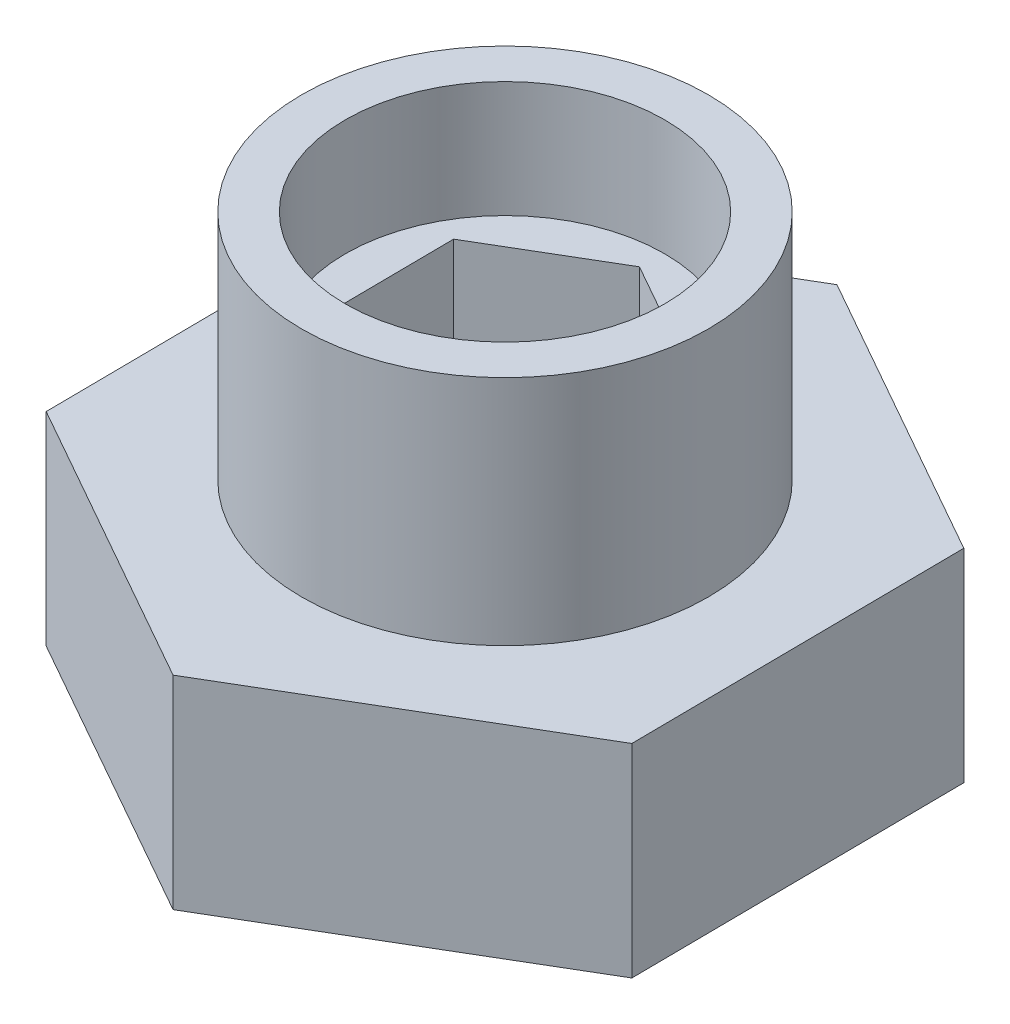
ISO-10303-21;
HEADER;
FILE_DESCRIPTION(('STEP AP214'),'2;1');
FILE_NAME('part.step','',(''),(''),'','','');
FILE_SCHEMA(('AUTOMOTIVE_DESIGN { 1 0 10303 214 1 1 1 1 }'));
ENDSEC;
DATA;
#1=APPLICATION_CONTEXT('core data for automotive mechanical design processes');
#2=APPLICATION_PROTOCOL_DEFINITION('international standard','automotive_design',2000,#1);
#3=PRODUCT_CONTEXT('',#1,'mechanical');
#4=PRODUCT('Part','Part','',(#3));
#5=PRODUCT_RELATED_PRODUCT_CATEGORY('part','',(#4));
#6=PRODUCT_DEFINITION_FORMATION('','',#4);
#7=PRODUCT_DEFINITION_CONTEXT('part definition',#1,'design');
#8=PRODUCT_DEFINITION('design','',#6,#7);
#9=PRODUCT_DEFINITION_SHAPE('','',#8);
#10=(LENGTH_UNIT() NAMED_UNIT(*) SI_UNIT(.MILLI.,.METRE.));
#11=(NAMED_UNIT(*) PLANE_ANGLE_UNIT() SI_UNIT($,.RADIAN.));
#12=(NAMED_UNIT(*) SI_UNIT($,.STERADIAN.) SOLID_ANGLE_UNIT());
#13=UNCERTAINTY_MEASURE_WITH_UNIT(LENGTH_MEASURE(1.E-05),#10,'distance_accuracy_value','');
#14=(GEOMETRIC_REPRESENTATION_CONTEXT(3) GLOBAL_UNCERTAINTY_ASSIGNED_CONTEXT((#13)) GLOBAL_UNIT_ASSIGNED_CONTEXT((#10,
#11,#12)) REPRESENTATION_CONTEXT('',''));
#15=CARTESIAN_POINT('',(0.,0.,0.));
#16=DIRECTION('',(0.,0.,1.));
#17=DIRECTION('',(1.,0.,0.));
#18=AXIS2_PLACEMENT_3D('',#15,#16,#17);
#19=CARTESIAN_POINT('',(10.0530968349787,15.,5.68054375565173));
#20=DIRECTION('',(-0.999957022608578,0.,0.00927108061594633));
#21=DIRECTION('',(0.00927108061594633,0.,0.999957022608578));
#22=AXIS2_PLACEMENT_3D('',#19,#20,#21);
#23=PLANE('',#22);
#24=DIRECTION('',(-0.00927108061594633,0.,-0.999957022608578));
#25=VECTOR('',#24,1.);
#26=CARTESIAN_POINT('',(10.0530968349787,7.,5.68054375565173));
#27=LINE('',#26,#25);
#28=CARTESIAN_POINT('',(10.0530968349787,7.,5.68054375565173));
#29=VERTEX_POINT('',#28);
#30=CARTESIAN_POINT('',(9.94604361719283,7.,-5.86596536797065));
#31=VERTEX_POINT('',#30);
#32=EDGE_CURVE('E198',#29,#31,#27,.T.);
#33=ORIENTED_EDGE('',*,*,#32,.F.);
#34=DIRECTION('',(0.,-1.,0.));
#35=VECTOR('',#34,1.);
#36=CARTESIAN_POINT('',(10.0530968349787,15.,5.68054375565173));
#37=LINE('',#36,#35);
#38=CARTESIAN_POINT('',(10.0530968349787,0.,5.68054375565173));
#39=VERTEX_POINT('',#38);
#40=EDGE_CURVE('E218',#29,#39,#37,.T.);
#41=ORIENTED_EDGE('',*,*,#40,.T.);
#42=DIRECTION('',(-0.00927108061594633,0.,-0.999957022608578));
#43=VECTOR('',#42,1.);
#44=CARTESIAN_POINT('',(10.0530968349787,0.,5.68054375565173));
#45=LINE('',#44,#43);
#46=CARTESIAN_POINT('',(9.94604361719283,0.,-5.86596536797065));
#47=VERTEX_POINT('',#46);
#48=EDGE_CURVE('E200',#39,#47,#45,.T.);
#49=ORIENTED_EDGE('',*,*,#48,.T.);
#50=DIRECTION('',(0.,-1.,0.));
#51=VECTOR('',#50,1.);
#52=CARTESIAN_POINT('',(9.94604361719283,15.,-5.86596536797065));
#53=LINE('',#52,#51);
#54=EDGE_CURVE('E41',#31,#47,#53,.T.);
#55=ORIENTED_EDGE('',*,*,#54,.F.);
#56=EDGE_LOOP('',(#33,#41,#49,#55));
#57=FACE_BOUND('',#56,.T.);
#58=ADVANCED_FACE('F34',(#57),#23,.F.);
#59=CARTESIAN_POINT('',(9.94604361719283,15.,-5.86596536797065));
#60=DIRECTION('',(-0.491949519970346,0.,0.870623724579652));
#61=DIRECTION('',(0.870623724579652,0.,0.491949519970347));
#62=AXIS2_PLACEMENT_3D('',#59,#60,#61);
#63=PLANE('',#62);
#64=DIRECTION('',(-0.870623724579652,0.,-0.491949519970347));
#65=VECTOR('',#64,1.);
#66=CARTESIAN_POINT('',(9.94604361719283,7.,-5.86596536797065));
#67=LINE('',#66,#65);
#68=CARTESIAN_POINT('',(-0.107053217785902,7.,-11.5465091236224));
#69=VERTEX_POINT('',#68);
#70=EDGE_CURVE('E196',#31,#69,#67,.T.);
#71=ORIENTED_EDGE('',*,*,#70,.F.);
#72=ORIENTED_EDGE('',*,*,#54,.T.);
#73=DIRECTION('',(-0.870623724579652,0.,-0.491949519970346));
#74=VECTOR('',#73,1.);
#75=CARTESIAN_POINT('',(9.94604361719283,0.,-5.86596536797065));
#76=LINE('',#75,#74);
#77=CARTESIAN_POINT('',(-0.107053217785902,0.,-11.5465091236224));
#78=VERTEX_POINT('',#77);
#79=EDGE_CURVE('E203',#47,#78,#76,.T.);
#80=ORIENTED_EDGE('',*,*,#79,.T.);
#81=DIRECTION('',(0.,-1.,0.));
#82=VECTOR('',#81,1.);
#83=CARTESIAN_POINT('',(-0.107053217785902,15.,-11.5465091236224));
#84=LINE('',#83,#82);
#85=EDGE_CURVE('E226',#69,#78,#84,.T.);
#86=ORIENTED_EDGE('',*,*,#85,.F.);
#87=EDGE_LOOP('',(#71,#72,#80,#86));
#88=FACE_BOUND('',#87,.T.);
#89=ADVANCED_FACE('F231',(#88),#63,.F.);
#90=CARTESIAN_POINT('',(-0.107053217785902,15.,-11.5465091236224));
#91=DIRECTION('',(0.508007502638232,0.,0.861352643963706));
#92=DIRECTION('',(0.861352643963706,0.,-0.508007502638232));
#93=AXIS2_PLACEMENT_3D('',#90,#91,#92);
#94=PLANE('',#93);
#95=DIRECTION('',(-0.861352643963706,0.,0.508007502638232));
#96=VECTOR('',#95,1.);
#97=CARTESIAN_POINT('',(-0.107053217785902,7.,-11.5465091236224));
#98=LINE('',#97,#96);
#99=CARTESIAN_POINT('',(-10.0530968349787,7.,-5.68054375565173));
#100=VERTEX_POINT('',#99);
#101=EDGE_CURVE('E194',#69,#100,#98,.T.);
#102=ORIENTED_EDGE('',*,*,#101,.F.);
#103=ORIENTED_EDGE('',*,*,#85,.T.);
#104=DIRECTION('',(-0.861352643963706,0.,0.508007502638232));
#105=VECTOR('',#104,1.);
#106=CARTESIAN_POINT('',(-0.107053217785902,0.,-11.5465091236224));
#107=LINE('',#106,#105);
#108=CARTESIAN_POINT('',(-10.0530968349787,0.,-5.68054375565173));
#109=VERTEX_POINT('',#108);
#110=EDGE_CURVE('E206',#78,#109,#107,.T.);
#111=ORIENTED_EDGE('',*,*,#110,.T.);
#112=DIRECTION('',(0.,-1.,0.));
#113=VECTOR('',#112,1.);
#114=CARTESIAN_POINT('',(-10.0530968349787,15.,-5.68054375565173));
#115=LINE('',#114,#113);
#116=EDGE_CURVE('E224',#100,#109,#115,.T.);
#117=ORIENTED_EDGE('',*,*,#116,.F.);
#118=EDGE_LOOP('',(#102,#103,#111,#117));
#119=FACE_BOUND('',#118,.T.);
#120=ADVANCED_FACE('F255',(#119),#94,.F.);
#121=CARTESIAN_POINT('',(-10.0530968349787,15.,-5.68054375565173));
#122=DIRECTION('',(0.999957022608578,0.,-0.00927108061594633));
#123=DIRECTION('',(-0.00927108061594633,0.,-0.999957022608578));
#124=AXIS2_PLACEMENT_3D('',#121,#122,#123);
#125=PLANE('',#124);
#126=DIRECTION('',(0.00927108061594633,0.,0.999957022608578));
#127=VECTOR('',#126,1.);
#128=CARTESIAN_POINT('',(-10.0530968349787,7.,-5.68054375565173));
#129=LINE('',#128,#127);
#130=CARTESIAN_POINT('',(-9.94604361719282,7.,5.86596536797066));
#131=VERTEX_POINT('',#130);
#132=EDGE_CURVE('E192',#100,#131,#129,.T.);
#133=ORIENTED_EDGE('',*,*,#132,.F.);
#134=ORIENTED_EDGE('',*,*,#116,.T.);
#135=DIRECTION('',(0.00927108061594633,0.,0.999957022608578));
#136=VECTOR('',#135,1.);
#137=CARTESIAN_POINT('',(-10.0530968349787,0.,-5.68054375565173));
#138=LINE('',#137,#136);
#139=CARTESIAN_POINT('',(-9.94604361719282,0.,5.86596536797066));
#140=VERTEX_POINT('',#139);
#141=EDGE_CURVE('E209',#109,#140,#138,.T.);
#142=ORIENTED_EDGE('',*,*,#141,.T.);
#143=DIRECTION('',(0.,-1.,0.));
#144=VECTOR('',#143,1.);
#145=CARTESIAN_POINT('',(-9.94604361719282,15.,5.86596536797066));
#146=LINE('',#145,#144);
#147=EDGE_CURVE('E222',#131,#140,#146,.T.);
#148=ORIENTED_EDGE('',*,*,#147,.F.);
#149=EDGE_LOOP('',(#133,#134,#142,#148));
#150=FACE_BOUND('',#149,.T.);
#151=ADVANCED_FACE('F251',(#150),#125,.F.);
#152=CARTESIAN_POINT('',(-9.94604361719282,15.,5.86596536797066));
#153=DIRECTION('',(0.491949519970346,0.,-0.870623724579652));
#154=DIRECTION('',(-0.870623724579652,0.,-0.491949519970346));
#155=AXIS2_PLACEMENT_3D('',#152,#153,#154);
#156=PLANE('',#155);
#157=DIRECTION('',(0.870623724579652,0.,0.491949519970346));
#158=VECTOR('',#157,1.);
#159=CARTESIAN_POINT('',(-9.94604361719282,7.,5.86596536797066));
#160=LINE('',#159,#158);
#161=CARTESIAN_POINT('',(0.107053217785901,7.,11.5465091236224));
#162=VERTEX_POINT('',#161);
#163=EDGE_CURVE('E55',#131,#162,#160,.T.);
#164=ORIENTED_EDGE('',*,*,#163,.F.);
#165=ORIENTED_EDGE('',*,*,#147,.T.);
#166=DIRECTION('',(0.870623724579652,0.,0.491949519970346));
#167=VECTOR('',#166,1.);
#168=CARTESIAN_POINT('',(-9.94604361719282,0.,5.86596536797066));
#169=LINE('',#168,#167);
#170=CARTESIAN_POINT('',(0.107053217785901,0.,11.5465091236224));
#171=VERTEX_POINT('',#170);
#172=EDGE_CURVE('E212',#140,#171,#169,.T.);
#173=ORIENTED_EDGE('',*,*,#172,.T.);
#174=DIRECTION('',(0.,-1.,0.));
#175=VECTOR('',#174,1.);
#176=CARTESIAN_POINT('',(0.107053217785901,15.,11.5465091236224));
#177=LINE('',#176,#175);
#178=EDGE_CURVE('E220',#162,#171,#177,.T.);
#179=ORIENTED_EDGE('',*,*,#178,.F.);
#180=EDGE_LOOP('',(#164,#165,#173,#179));
#181=FACE_BOUND('',#180,.T.);
#182=ADVANCED_FACE('F247',(#181),#156,.F.);
#183=CARTESIAN_POINT('',(0.107053217785901,15.,11.5465091236224));
#184=DIRECTION('',(-0.508007502638232,0.,-0.861352643963706));
#185=DIRECTION('',(-0.861352643963706,0.,0.508007502638232));
#186=AXIS2_PLACEMENT_3D('',#183,#184,#185);
#187=PLANE('',#186);
#188=DIRECTION('',(0.861352643963706,0.,-0.508007502638232));
#189=VECTOR('',#188,1.);
#190=CARTESIAN_POINT('',(0.107053217785901,7.,11.5465091236224));
#191=LINE('',#190,#189);
#192=EDGE_CURVE('E12',#162,#29,#191,.T.);
#193=ORIENTED_EDGE('',*,*,#192,.F.);
#194=ORIENTED_EDGE('',*,*,#178,.T.);
#195=DIRECTION('',(0.861352643963706,0.,-0.508007502638232));
#196=VECTOR('',#195,1.);
#197=CARTESIAN_POINT('',(0.107053217785901,0.,11.5465091236224));
#198=LINE('',#197,#196);
#199=EDGE_CURVE('E215',#171,#39,#198,.T.);
#200=ORIENTED_EDGE('',*,*,#199,.T.);
#201=ORIENTED_EDGE('',*,*,#40,.F.);
#202=EDGE_LOOP('',(#193,#194,#200,#201));
#203=FACE_BOUND('',#202,.T.);
#204=ADVANCED_FACE('F243',(#203),#187,.F.);
#205=CARTESIAN_POINT('',(0.,0.,0.));
#206=DIRECTION('',(0.,1.,0.));
#207=DIRECTION('',(0.,0.,1.));
#208=AXIS2_PLACEMENT_3D('',#205,#206,#207);
#209=PLANE('',#208);
#210=CARTESIAN_POINT('',(0.,0.,0.));
#211=DIRECTION('',(0.,1.,0.));
#212=DIRECTION('',(0.,0.,1.));
#213=AXIS2_PLACEMENT_3D('',#210,#211,#212);
#214=CIRCLE('',#213,3.);
#215=CARTESIAN_POINT('',(0.,0.,3.));
#216=VERTEX_POINT('',#215);
#217=EDGE_CURVE('E160',#216,#216,#214,.T.);
#218=ORIENTED_EDGE('',*,*,#217,.T.);
#219=EDGE_LOOP('',(#218));
#220=FACE_BOUND('',#219,.T.);
#221=ORIENTED_EDGE('',*,*,#48,.F.);
#222=ORIENTED_EDGE('',*,*,#199,.F.);
#223=ORIENTED_EDGE('',*,*,#172,.F.);
#224=ORIENTED_EDGE('',*,*,#141,.F.);
#225=ORIENTED_EDGE('',*,*,#110,.F.);
#226=ORIENTED_EDGE('',*,*,#79,.F.);
#227=EDGE_LOOP('',(#221,#222,#223,#224,#225,#226));
#228=FACE_BOUND('',#227,.T.);
#229=ADVANCED_FACE('F238',(#220,#228),#209,.F.);
#230=CARTESIAN_POINT('',(0.,7.,0.));
#231=DIRECTION('',(0.,1.,0.));
#232=DIRECTION('',(0.,0.,1.));
#233=AXIS2_PLACEMENT_3D('',#230,#231,#232);
#234=PLANE('',#233);
#235=CARTESIAN_POINT('',(0.,7.,0.));
#236=DIRECTION('',(0.,1.,0.));
#237=DIRECTION('',(0.,0.,1.));
#238=AXIS2_PLACEMENT_3D('',#235,#236,#237);
#239=CIRCLE('',#238,7.00000000000001);
#240=CARTESIAN_POINT('',(0.,7.,7.00000000000001));
#241=VERTEX_POINT('',#240);
#242=EDGE_CURVE('E186',#241,#241,#239,.T.);
#243=ORIENTED_EDGE('',*,*,#242,.F.);
#244=EDGE_LOOP('',(#243));
#245=FACE_BOUND('',#244,.T.);
#246=ORIENTED_EDGE('',*,*,#32,.T.);
#247=ORIENTED_EDGE('',*,*,#70,.T.);
#248=ORIENTED_EDGE('',*,*,#101,.T.);
#249=ORIENTED_EDGE('',*,*,#132,.T.);
#250=ORIENTED_EDGE('',*,*,#163,.T.);
#251=ORIENTED_EDGE('',*,*,#192,.T.);
#252=EDGE_LOOP('',(#246,#247,#248,#249,#250,#251));
#253=FACE_BOUND('',#252,.T.);
#254=ADVANCED_FACE('F256',(#245,#253),#234,.T.);
#255=CARTESIAN_POINT('',(0.,7.,0.));
#256=DIRECTION('',(0.,1.,0.));
#257=DIRECTION('',(0.,0.,1.));
#258=AXIS2_PLACEMENT_3D('',#255,#256,#257);
#259=CYLINDRICAL_SURFACE('',#258,7.00000000000001);
#260=ORIENTED_EDGE('',*,*,#242,.T.);
#261=EDGE_LOOP('',(#260));
#262=FACE_BOUND('',#261,.T.);
#263=CARTESIAN_POINT('',(0.,15.,0.));
#264=DIRECTION('',(0.,1.,0.));
#265=DIRECTION('',(0.,0.,1.));
#266=AXIS2_PLACEMENT_3D('',#263,#264,#265);
#267=CIRCLE('',#266,7.00000000000001);
#268=CARTESIAN_POINT('',(0.,15.,7.00000000000001));
#269=VERTEX_POINT('',#268);
#270=EDGE_CURVE('E183',#269,#269,#267,.T.);
#271=ORIENTED_EDGE('',*,*,#270,.F.);
#272=EDGE_LOOP('',(#271));
#273=FACE_BOUND('',#272,.T.);
#274=ADVANCED_FACE('F258',(#262,#273),#259,.T.);
#275=CARTESIAN_POINT('',(0.,15.,0.));
#276=DIRECTION('',(0.,1.,0.));
#277=DIRECTION('',(0.,0.,1.));
#278=AXIS2_PLACEMENT_3D('',#275,#276,#277);
#279=PLANE('',#278);
#280=CARTESIAN_POINT('',(0.,15.,0.));
#281=DIRECTION('',(0.,1.,0.));
#282=DIRECTION('',(0.,0.,1.));
#283=AXIS2_PLACEMENT_3D('',#280,#281,#282);
#284=CIRCLE('',#283,5.5);
#285=CARTESIAN_POINT('',(0.,15.,5.5));
#286=VERTEX_POINT('',#285);
#287=EDGE_CURVE('E172',#286,#286,#284,.T.);
#288=ORIENTED_EDGE('',*,*,#287,.F.);
#289=EDGE_LOOP('',(#288));
#290=FACE_BOUND('',#289,.T.);
#291=ORIENTED_EDGE('',*,*,#270,.T.);
#292=EDGE_LOOP('',(#291));
#293=FACE_BOUND('',#292,.T.);
#294=ADVANCED_FACE('F265',(#290,#293),#279,.T.);
#295=CARTESIAN_POINT('',(0.,11.,0.));
#296=DIRECTION('',(0.,1.,0.));
#297=DIRECTION('',(0.,0.,1.));
#298=AXIS2_PLACEMENT_3D('',#295,#296,#297);
#299=CYLINDRICAL_SURFACE('',#298,5.5);
#300=CARTESIAN_POINT('',(0.,11.,0.));
#301=DIRECTION('',(0.,1.,0.));
#302=DIRECTION('',(0.,0.,1.));
#303=AXIS2_PLACEMENT_3D('',#300,#301,#302);
#304=CIRCLE('',#303,5.5);
#305=CARTESIAN_POINT('',(0.,11.,5.5));
#306=VERTEX_POINT('',#305);
#307=EDGE_CURVE('E180',#306,#306,#304,.T.);
#308=ORIENTED_EDGE('',*,*,#307,.F.);
#309=EDGE_LOOP('',(#308));
#310=FACE_BOUND('',#309,.T.);
#311=ORIENTED_EDGE('',*,*,#287,.T.);
#312=EDGE_LOOP('',(#311));
#313=FACE_BOUND('',#312,.T.);
#314=ADVANCED_FACE('F287',(#310,#313),#299,.F.);
#315=CARTESIAN_POINT('',(0.,11.,0.));
#316=DIRECTION('',(0.,1.,0.));
#317=DIRECTION('',(0.,0.,1.));
#318=AXIS2_PLACEMENT_3D('',#315,#316,#317);
#319=PLANE('',#318);
#320=DIRECTION('',(-0.861352643963706,0.,0.508007502638232));
#321=VECTOR('',#320,1.);
#322=CARTESIAN_POINT('',(-0.0433565532032944,11.,-4.67633619506707));
#323=LINE('',#322,#321);
#324=CARTESIAN_POINT('',(-0.0433565532032944,11.,-4.67633619506707));
#325=VERTEX_POINT('',#324);
#326=CARTESIAN_POINT('',(-4.07150421816639,11.,-2.30062022103895));
#327=VERTEX_POINT('',#326);
#328=EDGE_CURVE('E48',#325,#327,#323,.T.);
#329=ORIENTED_EDGE('',*,*,#328,.F.);
#330=DIRECTION('',(-0.870623724579652,0.,-0.491949519970346));
#331=VECTOR('',#330,1.);
#332=CARTESIAN_POINT('',(4.02814766496309,11.,-2.37571597402812));
#333=LINE('',#332,#331);
#334=CARTESIAN_POINT('',(4.02814766496309,11.,-2.37571597402812));
#335=VERTEX_POINT('',#334);
#336=EDGE_CURVE('E142',#335,#325,#333,.T.);
#337=ORIENTED_EDGE('',*,*,#336,.F.);
#338=DIRECTION('',(-0.00927108061594624,0.,-0.999957022608578));
#339=VECTOR('',#338,1.);
#340=CARTESIAN_POINT('',(4.07150421816639,11.,2.30062022103895));
#341=LINE('',#340,#339);
#342=CARTESIAN_POINT('',(4.07150421816639,11.,2.30062022103895));
#343=VERTEX_POINT('',#342);
#344=EDGE_CURVE('E145',#343,#335,#341,.T.);
#345=ORIENTED_EDGE('',*,*,#344,.F.);
#346=DIRECTION('',(0.861352643963706,0.,-0.508007502638232));
#347=VECTOR('',#346,1.);
#348=CARTESIAN_POINT('',(0.0433565532032901,11.,4.67633619506707));
#349=LINE('',#348,#347);
#350=CARTESIAN_POINT('',(0.0433565532032901,11.,4.67633619506707));
#351=VERTEX_POINT('',#350);
#352=EDGE_CURVE('E165',#351,#343,#349,.T.);
#353=ORIENTED_EDGE('',*,*,#352,.F.);
#354=DIRECTION('',(0.870623724579652,0.,0.491949519970346));
#355=VECTOR('',#354,1.);
#356=CARTESIAN_POINT('',(-4.0281476649631,11.,2.37571597402812));
#357=LINE('',#356,#355);
#358=CARTESIAN_POINT('',(-4.0281476649631,11.,2.37571597402812));
#359=VERTEX_POINT('',#358);
#360=EDGE_CURVE('E162',#359,#351,#357,.T.);
#361=ORIENTED_EDGE('',*,*,#360,.F.);
#362=DIRECTION('',(0.00927108061594643,0.,0.999957022608578));
#363=VECTOR('',#362,1.);
#364=CARTESIAN_POINT('',(-4.07150421816639,11.,-2.30062022103895));
#365=LINE('',#364,#363);
#366=EDGE_CURVE('E159',#327,#359,#365,.T.);
#367=ORIENTED_EDGE('',*,*,#366,.F.);
#368=EDGE_LOOP('',(#329,#337,#345,#353,#361,#367));
#369=FACE_BOUND('',#368,.T.);
#370=ORIENTED_EDGE('',*,*,#307,.T.);
#371=EDGE_LOOP('',(#370));
#372=FACE_BOUND('',#371,.T.);
#373=ADVANCED_FACE('F292',(#369,#372),#319,.T.);
#374=CARTESIAN_POINT('',(-0.0433565532032944,7.,-4.67633619506707));
#375=DIRECTION('',(-0.508007502638232,0.,-0.861352643963706));
#376=DIRECTION('',(-0.861352643963706,0.,0.508007502638232));
#377=AXIS2_PLACEMENT_3D('',#374,#375,#376);
#378=PLANE('',#377);
#379=ORIENTED_EDGE('',*,*,#328,.T.);
#380=DIRECTION('',(0.,1.,0.));
#381=VECTOR('',#380,1.);
#382=CARTESIAN_POINT('',(-4.07150421816639,7.,-2.30062022103895));
#383=LINE('',#382,#381);
#384=CARTESIAN_POINT('',(-4.07150421816639,7.,-2.30062022103895));
#385=VERTEX_POINT('',#384);
#386=EDGE_CURVE('E119',#385,#327,#383,.T.);
#387=ORIENTED_EDGE('',*,*,#386,.F.);
#388=DIRECTION('',(-0.861352643963706,0.,0.508007502638232));
#389=VECTOR('',#388,1.);
#390=CARTESIAN_POINT('',(-0.0433565532032944,7.,-4.67633619506707));
#391=LINE('',#390,#389);
#392=CARTESIAN_POINT('',(-0.0433565532032944,7.,-4.67633619506707));
#393=VERTEX_POINT('',#392);
#394=EDGE_CURVE('E123',#393,#385,#391,.T.);
#395=ORIENTED_EDGE('',*,*,#394,.F.);
#396=DIRECTION('',(0.,1.,0.));
#397=VECTOR('',#396,1.);
#398=CARTESIAN_POINT('',(-0.0433565532032944,7.,-4.67633619506707));
#399=LINE('',#398,#397);
#400=EDGE_CURVE('E170',#393,#325,#399,.T.);
#401=ORIENTED_EDGE('',*,*,#400,.T.);
#402=EDGE_LOOP('',(#379,#387,#395,#401));
#403=FACE_BOUND('',#402,.T.);
#404=ADVANCED_FACE('F121',(#403),#378,.F.);
#405=CARTESIAN_POINT('',(4.02814766496309,7.,-2.37571597402812));
#406=DIRECTION('',(0.491949519970346,0.,-0.870623724579652));
#407=DIRECTION('',(-0.870623724579652,0.,-0.491949519970346));
#408=AXIS2_PLACEMENT_3D('',#405,#406,#407);
#409=PLANE('',#408);
#410=ORIENTED_EDGE('',*,*,#336,.T.);
#411=ORIENTED_EDGE('',*,*,#400,.F.);
#412=DIRECTION('',(-0.870623724579652,0.,-0.491949519970346));
#413=VECTOR('',#412,1.);
#414=CARTESIAN_POINT('',(4.02814766496309,7.,-2.37571597402812));
#415=LINE('',#414,#413);
#416=CARTESIAN_POINT('',(4.02814766496309,7.,-2.37571597402812));
#417=VERTEX_POINT('',#416);
#418=EDGE_CURVE('E129',#417,#393,#415,.T.);
#419=ORIENTED_EDGE('',*,*,#418,.F.);
#420=DIRECTION('',(0.,1.,0.));
#421=VECTOR('',#420,1.);
#422=CARTESIAN_POINT('',(4.02814766496309,7.,-2.37571597402812));
#423=LINE('',#422,#421);
#424=EDGE_CURVE('E173',#417,#335,#423,.T.);
#425=ORIENTED_EDGE('',*,*,#424,.T.);
#426=EDGE_LOOP('',(#410,#411,#419,#425));
#427=FACE_BOUND('',#426,.T.);
#428=ADVANCED_FACE('F309',(#427),#409,.F.);
#429=CARTESIAN_POINT('',(4.07150421816639,7.,2.30062022103895));
#430=DIRECTION('',(0.999957022608578,0.,-0.00927108061594624));
#431=DIRECTION('',(-0.00927108061594624,0.,-0.999957022608578));
#432=AXIS2_PLACEMENT_3D('',#429,#430,#431);
#433=PLANE('',#432);
#434=ORIENTED_EDGE('',*,*,#344,.T.);
#435=ORIENTED_EDGE('',*,*,#424,.F.);
#436=DIRECTION('',(-0.00927108061594624,0.,-0.999957022608578));
#437=VECTOR('',#436,1.);
#438=CARTESIAN_POINT('',(4.07150421816639,7.,2.30062022103895));
#439=LINE('',#438,#437);
#440=CARTESIAN_POINT('',(4.07150421816639,7.,2.30062022103895));
#441=VERTEX_POINT('',#440);
#442=EDGE_CURVE('E155',#441,#417,#439,.T.);
#443=ORIENTED_EDGE('',*,*,#442,.F.);
#444=DIRECTION('',(0.,1.,0.));
#445=VECTOR('',#444,1.);
#446=CARTESIAN_POINT('',(4.07150421816639,7.,2.30062022103895));
#447=LINE('',#446,#445);
#448=EDGE_CURVE('E175',#441,#343,#447,.T.);
#449=ORIENTED_EDGE('',*,*,#448,.T.);
#450=EDGE_LOOP('',(#434,#435,#443,#449));
#451=FACE_BOUND('',#450,.T.);
#452=ADVANCED_FACE('F319',(#451),#433,.F.);
#453=CARTESIAN_POINT('',(0.0433565532032901,7.,4.67633619506707));
#454=DIRECTION('',(0.508007502638232,0.,0.861352643963706));
#455=DIRECTION('',(0.861352643963706,0.,-0.508007502638232));
#456=AXIS2_PLACEMENT_3D('',#453,#454,#455);
#457=PLANE('',#456);
#458=ORIENTED_EDGE('',*,*,#352,.T.);
#459=ORIENTED_EDGE('',*,*,#448,.F.);
#460=DIRECTION('',(0.861352643963706,0.,-0.508007502638232));
#461=VECTOR('',#460,1.);
#462=CARTESIAN_POINT('',(0.0433565532032901,7.,4.67633619506707));
#463=LINE('',#462,#461);
#464=CARTESIAN_POINT('',(0.0433565532032901,7.,4.67633619506707));
#465=VERTEX_POINT('',#464);
#466=EDGE_CURVE('E152',#465,#441,#463,.T.);
#467=ORIENTED_EDGE('',*,*,#466,.F.);
#468=DIRECTION('',(0.,1.,0.));
#469=VECTOR('',#468,1.);
#470=CARTESIAN_POINT('',(0.0433565532032901,7.,4.67633619506707));
#471=LINE('',#470,#469);
#472=EDGE_CURVE('E177',#465,#351,#471,.T.);
#473=ORIENTED_EDGE('',*,*,#472,.T.);
#474=EDGE_LOOP('',(#458,#459,#467,#473));
#475=FACE_BOUND('',#474,.T.);
#476=ADVANCED_FACE('F315',(#475),#457,.F.);
#477=CARTESIAN_POINT('',(-4.0281476649631,7.,2.37571597402812));
#478=DIRECTION('',(-0.491949519970346,0.,0.870623724579652));
#479=DIRECTION('',(0.870623724579652,0.,0.491949519970346));
#480=AXIS2_PLACEMENT_3D('',#477,#478,#479);
#481=PLANE('',#480);
#482=ORIENTED_EDGE('',*,*,#360,.T.);
#483=ORIENTED_EDGE('',*,*,#472,.F.);
#484=DIRECTION('',(0.870623724579652,0.,0.491949519970346));
#485=VECTOR('',#484,1.);
#486=CARTESIAN_POINT('',(-4.0281476649631,7.,2.37571597402812));
#487=LINE('',#486,#485);
#488=CARTESIAN_POINT('',(-4.0281476649631,7.,2.37571597402812));
#489=VERTEX_POINT('',#488);
#490=EDGE_CURVE('E137',#489,#465,#487,.T.);
#491=ORIENTED_EDGE('',*,*,#490,.F.);
#492=DIRECTION('',(0.,1.,0.));
#493=VECTOR('',#492,1.);
#494=CARTESIAN_POINT('',(-4.0281476649631,7.,2.37571597402812));
#495=LINE('',#494,#493);
#496=EDGE_CURVE('E128',#489,#359,#495,.T.);
#497=ORIENTED_EDGE('',*,*,#496,.T.);
#498=EDGE_LOOP('',(#482,#483,#491,#497));
#499=FACE_BOUND('',#498,.T.);
#500=ADVANCED_FACE('F312',(#499),#481,.F.);
#501=CARTESIAN_POINT('',(-4.07150421816639,7.,-2.30062022103895));
#502=DIRECTION('',(-0.999957022608578,0.,0.00927108061594643));
#503=DIRECTION('',(0.00927108061594643,0.,0.999957022608578));
#504=AXIS2_PLACEMENT_3D('',#501,#502,#503);
#505=PLANE('',#504);
#506=ORIENTED_EDGE('',*,*,#366,.T.);
#507=ORIENTED_EDGE('',*,*,#496,.F.);
#508=DIRECTION('',(0.00927108061594643,0.,0.999957022608578));
#509=VECTOR('',#508,1.);
#510=CARTESIAN_POINT('',(-4.07150421816639,7.,-2.30062022103895));
#511=LINE('',#510,#509);
#512=EDGE_CURVE('E132',#385,#489,#511,.T.);
#513=ORIENTED_EDGE('',*,*,#512,.F.);
#514=ORIENTED_EDGE('',*,*,#386,.T.);
#515=EDGE_LOOP('',(#506,#507,#513,#514));
#516=FACE_BOUND('',#515,.T.);
#517=ADVANCED_FACE('F133',(#516),#505,.F.);
#518=CARTESIAN_POINT('',(0.,7.,0.));
#519=DIRECTION('',(0.,1.,0.));
#520=DIRECTION('',(0.,0.,1.));
#521=AXIS2_PLACEMENT_3D('',#518,#519,#520);
#522=PLANE('',#521);
#523=CARTESIAN_POINT('',(0.,7.,0.));
#524=DIRECTION('',(0.,1.,0.));
#525=DIRECTION('',(0.,0.,1.));
#526=AXIS2_PLACEMENT_3D('',#523,#524,#525);
#527=CIRCLE('',#526,3.);
#528=CARTESIAN_POINT('',(0.,7.,3.));
#529=VERTEX_POINT('',#528);
#530=EDGE_CURVE('E148',#529,#529,#527,.T.);
#531=ORIENTED_EDGE('',*,*,#530,.F.);
#532=EDGE_LOOP('',(#531));
#533=FACE_BOUND('',#532,.T.);
#534=ORIENTED_EDGE('',*,*,#394,.T.);
#535=ORIENTED_EDGE('',*,*,#512,.T.);
#536=ORIENTED_EDGE('',*,*,#490,.T.);
#537=ORIENTED_EDGE('',*,*,#466,.T.);
#538=ORIENTED_EDGE('',*,*,#442,.T.);
#539=ORIENTED_EDGE('',*,*,#418,.T.);
#540=EDGE_LOOP('',(#534,#535,#536,#537,#538,#539));
#541=FACE_BOUND('',#540,.T.);
#542=ADVANCED_FACE('F139',(#533,#541),#522,.T.);
#543=CARTESIAN_POINT('',(0.,0.,0.));
#544=DIRECTION('',(0.,1.,0.));
#545=DIRECTION('',(0.,0.,1.));
#546=AXIS2_PLACEMENT_3D('',#543,#544,#545);
#547=CYLINDRICAL_SURFACE('',#546,3.);
#548=ORIENTED_EDGE('',*,*,#217,.F.);
#549=EDGE_LOOP('',(#548));
#550=FACE_BOUND('',#549,.T.);
#551=ORIENTED_EDGE('',*,*,#530,.T.);
#552=EDGE_LOOP('',(#551));
#553=FACE_BOUND('',#552,.T.);
#554=ADVANCED_FACE('F329',(#550,#553),#547,.F.);
#555=CLOSED_SHELL('',(#58,#89,#120,#151,#182,#204,#229,#254,#274,#294,#314,#373,#404,#428,#452,
#476,#500,#517,#542,#554));
#556=MANIFOLD_SOLID_BREP('B2',#555);
#557=ADVANCED_BREP_SHAPE_REPRESENTATION('',(#18,#556),#14);
#558=SHAPE_DEFINITION_REPRESENTATION(#9,#557);
ENDSEC;
END-ISO-10303-21;
